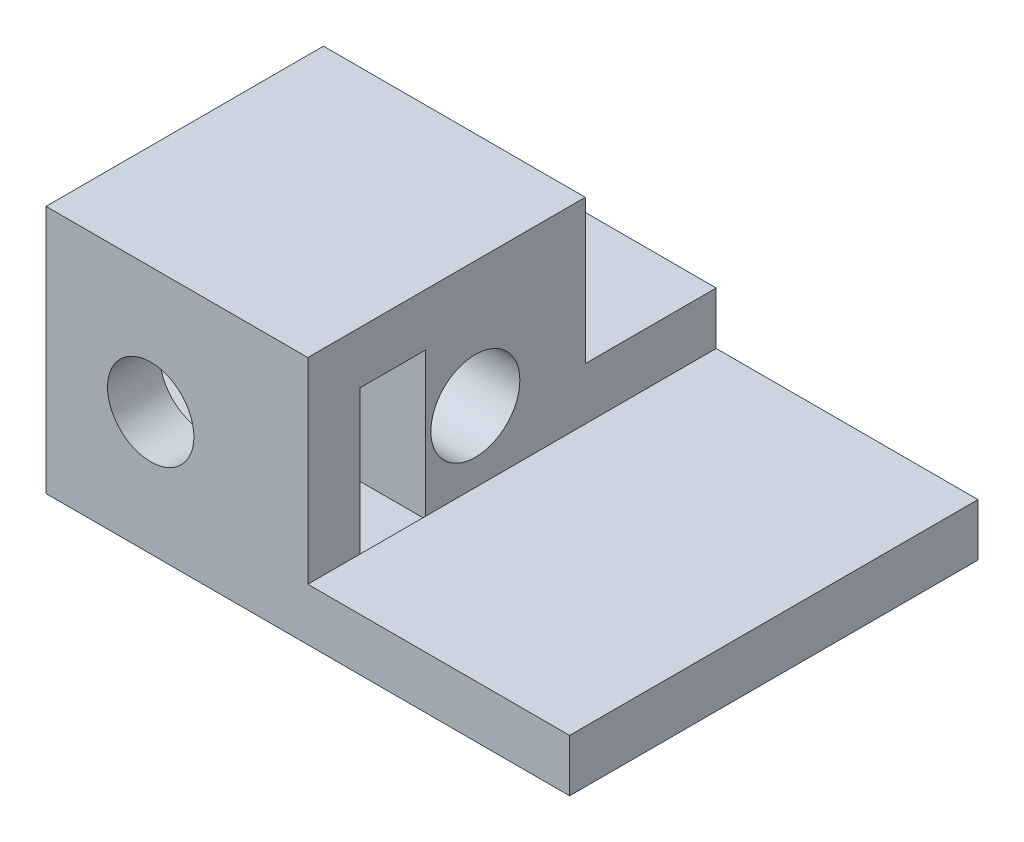
ISO-10303-21;
HEADER;
FILE_DESCRIPTION(('STEP AP214'),'2;1');
FILE_NAME('part.step','',(''),(''),'','','');
FILE_SCHEMA(('AUTOMOTIVE_DESIGN { 1 0 10303 214 1 1 1 1 }'));
ENDSEC;
DATA;
#1=APPLICATION_CONTEXT('core data for automotive mechanical design processes');
#2=APPLICATION_PROTOCOL_DEFINITION('international standard','automotive_design',2000,#1);
#3=PRODUCT_CONTEXT('',#1,'mechanical');
#4=PRODUCT('Part','Part','',(#3));
#5=PRODUCT_RELATED_PRODUCT_CATEGORY('part','',(#4));
#6=PRODUCT_DEFINITION_FORMATION('','',#4);
#7=PRODUCT_DEFINITION_CONTEXT('part definition',#1,'design');
#8=PRODUCT_DEFINITION('design','',#6,#7);
#9=PRODUCT_DEFINITION_SHAPE('','',#8);
#10=(LENGTH_UNIT() NAMED_UNIT(*) SI_UNIT(.MILLI.,.METRE.));
#11=(NAMED_UNIT(*) PLANE_ANGLE_UNIT() SI_UNIT($,.RADIAN.));
#12=(NAMED_UNIT(*) SI_UNIT($,.STERADIAN.) SOLID_ANGLE_UNIT());
#13=UNCERTAINTY_MEASURE_WITH_UNIT(LENGTH_MEASURE(1.E-05),#10,'distance_accuracy_value','');
#14=(GEOMETRIC_REPRESENTATION_CONTEXT(3) GLOBAL_UNCERTAINTY_ASSIGNED_CONTEXT((#13)) GLOBAL_UNIT_ASSIGNED_CONTEXT((#10,
#11,#12)) REPRESENTATION_CONTEXT('',''));
#15=CARTESIAN_POINT('',(0.,0.,0.));
#16=DIRECTION('',(0.,0.,1.));
#17=DIRECTION('',(1.,0.,0.));
#18=AXIS2_PLACEMENT_3D('',#15,#16,#17);
#19=CARTESIAN_POINT('',(10.,4.,52.5));
#20=DIRECTION('',(-1.,0.,0.));
#21=DIRECTION('',(0.,0.,1.));
#22=AXIS2_PLACEMENT_3D('',#19,#20,#21);
#23=PLANE('',#22);
#24=CARTESIAN_POINT('',(10.,4.7,56.7));
#25=DIRECTION('',(1.,0.,0.));
#26=DIRECTION('',(0.,0.,-1.));
#27=AXIS2_PLACEMENT_3D('',#24,#25,#26);
#28=CIRCLE('',#27,1.7);
#29=CARTESIAN_POINT('',(10.,4.7,55.));
#30=VERTEX_POINT('',#29);
#31=EDGE_CURVE('E406',#30,#30,#28,.T.);
#32=ORIENTED_EDGE('',*,*,#31,.F.);
#33=EDGE_LOOP('',(#32));
#34=FACE_BOUND('',#33,.T.);
#35=DIRECTION('',(0.,0.,-1.));
#36=VECTOR('',#35,1.);
#37=CARTESIAN_POINT('',(10.,2.,52.5));
#38=LINE('',#37,#36);
#39=CARTESIAN_POINT('',(10.,2.,58.6));
#40=VERTEX_POINT('',#39);
#41=CARTESIAN_POINT('',(10.,2.,47.5));
#42=VERTEX_POINT('',#41);
#43=EDGE_CURVE('E428',#40,#42,#38,.T.);
#44=ORIENTED_EDGE('',*,*,#43,.T.);
#45=DIRECTION('',(0.,1.,0.));
#46=VECTOR('',#45,1.);
#47=CARTESIAN_POINT('',(10.,4.,47.5));
#48=LINE('',#47,#46);
#49=CARTESIAN_POINT('',(10.,4.,47.5));
#50=VERTEX_POINT('',#49);
#51=EDGE_CURVE('E137',#42,#50,#48,.T.);
#52=ORIENTED_EDGE('',*,*,#51,.T.);
#53=DIRECTION('',(0.,0.,-1.));
#54=VECTOR('',#53,1.);
#55=CARTESIAN_POINT('',(10.,4.,52.5));
#56=LINE('',#55,#54);
#57=CARTESIAN_POINT('',(10.,4.,52.5));
#58=VERTEX_POINT('',#57);
#59=EDGE_CURVE('E426',#58,#50,#56,.T.);
#60=ORIENTED_EDGE('',*,*,#59,.F.);
#61=DIRECTION('',(0.,1.,0.));
#62=VECTOR('',#61,1.);
#63=CARTESIAN_POINT('',(10.,9.49999999999999,52.5));
#64=LINE('',#63,#62);
#65=CARTESIAN_POINT('',(10.,9.49999999999999,52.5));
#66=VERTEX_POINT('',#65);
#67=EDGE_CURVE('E392',#58,#66,#64,.T.);
#68=ORIENTED_EDGE('',*,*,#67,.T.);
#69=DIRECTION('',(0.,0.,1.));
#70=VECTOR('',#69,1.);
#71=CARTESIAN_POINT('',(10.,9.49999999999999,52.5));
#72=LINE('',#71,#70);
#73=CARTESIAN_POINT('',(10.,9.49999999999999,63.1));
#74=VERTEX_POINT('',#73);
#75=EDGE_CURVE('E400',#66,#74,#72,.T.);
#76=ORIENTED_EDGE('',*,*,#75,.T.);
#77=DIRECTION('',(0.,-1.,0.));
#78=VECTOR('',#77,1.);
#79=CARTESIAN_POINT('',(10.,9.49999999999999,63.1));
#80=LINE('',#79,#78);
#81=CARTESIAN_POINT('',(10.,2.,63.1));
#82=VERTEX_POINT('',#81);
#83=EDGE_CURVE('E403',#74,#82,#80,.T.);
#84=ORIENTED_EDGE('',*,*,#83,.T.);
#85=DIRECTION('',(0.,0.,-1.));
#86=VECTOR('',#85,1.);
#87=CARTESIAN_POINT('',(10.,2.,73.2980390271856));
#88=LINE('',#87,#86);
#89=CARTESIAN_POINT('',(10.,2.,61.1));
#90=VERTEX_POINT('',#89);
#91=EDGE_CURVE('E152',#82,#90,#88,.T.);
#92=ORIENTED_EDGE('',*,*,#91,.T.);
#93=DIRECTION('',(0.,-1.,0.));
#94=VECTOR('',#93,1.);
#95=CARTESIAN_POINT('',(10.,7.49999999999999,61.1));
#96=LINE('',#95,#94);
#97=CARTESIAN_POINT('',(10.,7.49999999999999,61.1));
#98=VERTEX_POINT('',#97);
#99=EDGE_CURVE('E460',#98,#90,#96,.T.);
#100=ORIENTED_EDGE('',*,*,#99,.F.);
#101=DIRECTION('',(0.,0.,1.));
#102=VECTOR('',#101,1.);
#103=CARTESIAN_POINT('',(10.,7.49999999999999,61.1));
#104=LINE('',#103,#102);
#105=CARTESIAN_POINT('',(10.,7.49999999999999,58.6));
#106=VERTEX_POINT('',#105);
#107=EDGE_CURVE('E462',#106,#98,#104,.T.);
#108=ORIENTED_EDGE('',*,*,#107,.F.);
#109=DIRECTION('',(0.,1.,0.));
#110=VECTOR('',#109,1.);
#111=CARTESIAN_POINT('',(10.,7.49999999999999,58.6));
#112=LINE('',#111,#110);
#113=EDGE_CURVE('E175',#40,#106,#112,.T.);
#114=ORIENTED_EDGE('',*,*,#113,.F.);
#115=EDGE_LOOP('',(#44,#52,#60,#68,#76,#84,#92,#100,#108,#114));
#116=FACE_BOUND('',#115,.T.);
#117=ADVANCED_FACE('F33',(#34,#116),#23,.F.);
#118=CARTESIAN_POINT('',(20.,0.,52.5));
#119=DIRECTION('',(0.,1.,0.));
#120=DIRECTION('',(-1.,0.,0.));
#121=AXIS2_PLACEMENT_3D('',#118,#119,#120);
#122=PLANE('',#121);
#123=DIRECTION('',(0.,0.,-1.));
#124=VECTOR('',#123,1.);
#125=CARTESIAN_POINT('',(0.,0.,52.5));
#126=LINE('',#125,#124);
#127=CARTESIAN_POINT('',(0.,0.,63.1));
#128=VERTEX_POINT('',#127);
#129=CARTESIAN_POINT('',(0.,0.,47.5));
#130=VERTEX_POINT('',#129);
#131=EDGE_CURVE('E142',#128,#130,#126,.T.);
#132=ORIENTED_EDGE('',*,*,#131,.T.);
#133=DIRECTION('',(1.,0.,0.));
#134=VECTOR('',#133,1.);
#135=CARTESIAN_POINT('',(0.,0.,47.5));
#136=LINE('',#135,#134);
#137=CARTESIAN_POINT('',(20.,0.,47.5));
#138=VERTEX_POINT('',#137);
#139=EDGE_CURVE('E131',#130,#138,#136,.T.);
#140=ORIENTED_EDGE('',*,*,#139,.T.);
#141=DIRECTION('',(0.,0.,-1.));
#142=VECTOR('',#141,1.);
#143=CARTESIAN_POINT('',(20.,0.,52.5));
#144=LINE('',#143,#142);
#145=CARTESIAN_POINT('',(20.,0.,63.1));
#146=VERTEX_POINT('',#145);
#147=EDGE_CURVE('E11',#146,#138,#144,.T.);
#148=ORIENTED_EDGE('',*,*,#147,.F.);
#149=DIRECTION('',(1.,0.,0.));
#150=VECTOR('',#149,1.);
#151=CARTESIAN_POINT('',(0.,0.,63.1));
#152=LINE('',#151,#150);
#153=EDGE_CURVE('E415',#128,#146,#152,.T.);
#154=ORIENTED_EDGE('',*,*,#153,.F.);
#155=EDGE_LOOP('',(#132,#140,#148,#154));
#156=FACE_BOUND('',#155,.T.);
#157=ADVANCED_FACE('F35',(#156),#122,.F.);
#158=CARTESIAN_POINT('',(20.,2.,52.5));
#159=DIRECTION('',(-1.,0.,0.));
#160=DIRECTION('',(0.,0.,1.));
#161=AXIS2_PLACEMENT_3D('',#158,#159,#160);
#162=PLANE('',#161);
#163=ORIENTED_EDGE('',*,*,#147,.T.);
#164=DIRECTION('',(0.,1.,0.));
#165=VECTOR('',#164,1.);
#166=CARTESIAN_POINT('',(20.,0.,47.5));
#167=LINE('',#166,#165);
#168=CARTESIAN_POINT('',(20.,2.,47.5));
#169=VERTEX_POINT('',#168);
#170=EDGE_CURVE('E128',#138,#169,#167,.T.);
#171=ORIENTED_EDGE('',*,*,#170,.T.);
#172=DIRECTION('',(0.,0.,-1.));
#173=VECTOR('',#172,1.);
#174=CARTESIAN_POINT('',(20.,2.,52.5));
#175=LINE('',#174,#173);
#176=CARTESIAN_POINT('',(20.,2.,63.1));
#177=VERTEX_POINT('',#176);
#178=EDGE_CURVE('E42',#177,#169,#175,.T.);
#179=ORIENTED_EDGE('',*,*,#178,.F.);
#180=DIRECTION('',(0.,1.,0.));
#181=VECTOR('',#180,1.);
#182=CARTESIAN_POINT('',(20.,0.,63.1));
#183=LINE('',#182,#181);
#184=EDGE_CURVE('E147',#146,#177,#183,.T.);
#185=ORIENTED_EDGE('',*,*,#184,.F.);
#186=EDGE_LOOP('',(#163,#171,#179,#185));
#187=FACE_BOUND('',#186,.T.);
#188=ADVANCED_FACE('F145',(#187),#162,.F.);
#189=CARTESIAN_POINT('',(10.,2.,52.5));
#190=DIRECTION('',(0.,-1.,0.));
#191=DIRECTION('',(0.,0.,-1.));
#192=AXIS2_PLACEMENT_3D('',#189,#190,#191);
#193=PLANE('',#192);
#194=ORIENTED_EDGE('',*,*,#178,.T.);
#195=DIRECTION('',(-1.,0.,0.));
#196=VECTOR('',#195,1.);
#197=CARTESIAN_POINT('',(10.,2.,47.5));
#198=LINE('',#197,#196);
#199=EDGE_CURVE('E134',#169,#42,#198,.T.);
#200=ORIENTED_EDGE('',*,*,#199,.T.);
#201=ORIENTED_EDGE('',*,*,#43,.F.);
#202=EDGE_CURVE('E157',#90,#40,#88,.T.);
#203=ORIENTED_EDGE('',*,*,#202,.F.);
#204=ORIENTED_EDGE('',*,*,#91,.F.);
#205=DIRECTION('',(-1.,0.,0.));
#206=VECTOR('',#205,1.);
#207=CARTESIAN_POINT('',(20.,2.,63.1));
#208=LINE('',#207,#206);
#209=EDGE_CURVE('E151',#177,#82,#208,.T.);
#210=ORIENTED_EDGE('',*,*,#209,.F.);
#211=EDGE_LOOP('',(#194,#200,#201,#203,#204,#210));
#212=FACE_BOUND('',#211,.T.);
#213=ADVANCED_FACE('F223',(#212),#193,.F.);
#214=CARTESIAN_POINT('',(5.,4.,52.5));
#215=DIRECTION('',(0.,-1.,0.));
#216=DIRECTION('',(0.,0.,-1.));
#217=AXIS2_PLACEMENT_3D('',#214,#215,#216);
#218=PLANE('',#217);
#219=ORIENTED_EDGE('',*,*,#59,.T.);
#220=DIRECTION('',(-1.,0.,0.));
#221=VECTOR('',#220,1.);
#222=CARTESIAN_POINT('',(0.,4.,47.5));
#223=LINE('',#222,#221);
#224=CARTESIAN_POINT('',(0.,4.,47.5));
#225=VERTEX_POINT('',#224);
#226=EDGE_CURVE('E58',#50,#225,#223,.T.);
#227=ORIENTED_EDGE('',*,*,#226,.T.);
#228=DIRECTION('',(0.,0.,1.));
#229=VECTOR('',#228,1.);
#230=CARTESIAN_POINT('',(0.,4.,47.5));
#231=LINE('',#230,#229);
#232=CARTESIAN_POINT('',(0.,4.,52.5));
#233=VERTEX_POINT('',#232);
#234=EDGE_CURVE('E422',#225,#233,#231,.T.);
#235=ORIENTED_EDGE('',*,*,#234,.T.);
#236=DIRECTION('',(-1.,0.,0.));
#237=VECTOR('',#236,1.);
#238=CARTESIAN_POINT('',(5.,4.,52.5));
#239=LINE('',#238,#237);
#240=EDGE_CURVE('E393',#58,#233,#239,.T.);
#241=ORIENTED_EDGE('',*,*,#240,.F.);
#242=EDGE_LOOP('',(#219,#227,#235,#241));
#243=FACE_BOUND('',#242,.T.);
#244=ADVANCED_FACE('F221',(#243),#218,.F.);
#245=CARTESIAN_POINT('',(0.,0.,52.5));
#246=DIRECTION('',(1.,0.,0.));
#247=DIRECTION('',(0.,0.,-1.));
#248=AXIS2_PLACEMENT_3D('',#245,#246,#247);
#249=PLANE('',#248);
#250=DIRECTION('',(0.,-1.,0.));
#251=VECTOR('',#250,1.);
#252=CARTESIAN_POINT('',(0.,0.,47.5));
#253=LINE('',#252,#251);
#254=EDGE_CURVE('E49',#225,#130,#253,.T.);
#255=ORIENTED_EDGE('',*,*,#254,.T.);
#256=ORIENTED_EDGE('',*,*,#131,.F.);
#257=DIRECTION('',(0.,-1.,0.));
#258=VECTOR('',#257,1.);
#259=CARTESIAN_POINT('',(0.,9.49999999999999,63.1));
#260=LINE('',#259,#258);
#261=CARTESIAN_POINT('',(0.,9.49999999999999,63.1));
#262=VERTEX_POINT('',#261);
#263=EDGE_CURVE('E409',#262,#128,#260,.T.);
#264=ORIENTED_EDGE('',*,*,#263,.F.);
#265=DIRECTION('',(0.,0.,1.));
#266=VECTOR('',#265,1.);
#267=CARTESIAN_POINT('',(0.,9.49999999999999,52.5));
#268=LINE('',#267,#266);
#269=CARTESIAN_POINT('',(0.,9.49999999999999,52.5));
#270=VERTEX_POINT('',#269);
#271=EDGE_CURVE('E437',#270,#262,#268,.T.);
#272=ORIENTED_EDGE('',*,*,#271,.F.);
#273=DIRECTION('',(0.,1.,0.));
#274=VECTOR('',#273,1.);
#275=CARTESIAN_POINT('',(0.,3.74294307873424,52.5));
#276=LINE('',#275,#274);
#277=EDGE_CURVE('E414',#233,#270,#276,.T.);
#278=ORIENTED_EDGE('',*,*,#277,.F.);
#279=ORIENTED_EDGE('',*,*,#234,.F.);
#280=EDGE_LOOP('',(#255,#256,#264,#272,#278,#279));
#281=FACE_BOUND('',#280,.T.);
#282=DIRECTION('',(0.,0.,-1.));
#283=VECTOR('',#282,1.);
#284=CARTESIAN_POINT('',(0.,1.89999999999999,61.1));
#285=LINE('',#284,#283);
#286=CARTESIAN_POINT('',(0.,1.89999999999999,61.1));
#287=VERTEX_POINT('',#286);
#288=CARTESIAN_POINT('',(0.,1.89999999999999,58.6));
#289=VERTEX_POINT('',#288);
#290=EDGE_CURVE('E450',#287,#289,#285,.T.);
#291=ORIENTED_EDGE('',*,*,#290,.T.);
#292=DIRECTION('',(0.,1.,0.));
#293=VECTOR('',#292,1.);
#294=CARTESIAN_POINT('',(0.,7.49999999999999,58.6));
#295=LINE('',#294,#293);
#296=CARTESIAN_POINT('',(0.,7.49999999999999,58.6));
#297=VERTEX_POINT('',#296);
#298=EDGE_CURVE('E176',#289,#297,#295,.T.);
#299=ORIENTED_EDGE('',*,*,#298,.T.);
#300=DIRECTION('',(0.,0.,1.));
#301=VECTOR('',#300,1.);
#302=CARTESIAN_POINT('',(0.,7.49999999999999,61.1));
#303=LINE('',#302,#301);
#304=CARTESIAN_POINT('',(0.,7.49999999999999,61.1));
#305=VERTEX_POINT('',#304);
#306=EDGE_CURVE('E472',#297,#305,#303,.T.);
#307=ORIENTED_EDGE('',*,*,#306,.T.);
#308=DIRECTION('',(0.,-1.,0.));
#309=VECTOR('',#308,1.);
#310=CARTESIAN_POINT('',(0.,7.49999999999999,61.1));
#311=LINE('',#310,#309);
#312=EDGE_CURVE('E470',#305,#287,#311,.T.);
#313=ORIENTED_EDGE('',*,*,#312,.T.);
#314=EDGE_LOOP('',(#291,#299,#307,#313));
#315=FACE_BOUND('',#314,.T.);
#316=CARTESIAN_POINT('',(0.,4.7,56.7));
#317=DIRECTION('',(1.,0.,0.));
#318=DIRECTION('',(0.,0.,-1.));
#319=AXIS2_PLACEMENT_3D('',#316,#317,#318);
#320=CIRCLE('',#319,1.7);
#321=CARTESIAN_POINT('',(0.,4.7,55.));
#322=VERTEX_POINT('',#321);
#323=EDGE_CURVE('E401',#322,#322,#320,.T.);
#324=ORIENTED_EDGE('',*,*,#323,.T.);
#325=EDGE_LOOP('',(#324));
#326=FACE_BOUND('',#325,.T.);
#327=ADVANCED_FACE('F241',(#281,#315,#326),#249,.F.);
#328=CARTESIAN_POINT('',(0.,0.,47.5));
#329=DIRECTION('',(0.,0.,-1.));
#330=DIRECTION('',(-1.,0.,0.));
#331=AXIS2_PLACEMENT_3D('',#328,#329,#330);
#332=PLANE('',#331);
#333=ORIENTED_EDGE('',*,*,#226,.F.);
#334=ORIENTED_EDGE('',*,*,#51,.F.);
#335=ORIENTED_EDGE('',*,*,#199,.F.);
#336=ORIENTED_EDGE('',*,*,#170,.F.);
#337=ORIENTED_EDGE('',*,*,#139,.F.);
#338=ORIENTED_EDGE('',*,*,#254,.F.);
#339=EDGE_LOOP('',(#333,#334,#335,#336,#337,#338));
#340=FACE_BOUND('',#339,.T.);
#341=ADVANCED_FACE('F130',(#340),#332,.T.);
#342=CARTESIAN_POINT('',(0.,9.49999999999999,63.1));
#343=DIRECTION('',(0.,0.,1.));
#344=DIRECTION('',(1.,0.,0.));
#345=AXIS2_PLACEMENT_3D('',#342,#343,#344);
#346=PLANE('',#345);
#347=CARTESIAN_POINT('',(4.,4.69999999999999,63.1));
#348=DIRECTION('',(0.,0.,1.));
#349=DIRECTION('',(1.,0.,0.));
#350=AXIS2_PLACEMENT_3D('',#347,#348,#349);
#351=CIRCLE('',#350,1.65);
#352=CARTESIAN_POINT('',(5.65,4.69999999999999,63.1));
#353=VERTEX_POINT('',#352);
#354=EDGE_CURVE('E162',#353,#353,#351,.T.);
#355=ORIENTED_EDGE('',*,*,#354,.F.);
#356=EDGE_LOOP('',(#355));
#357=FACE_BOUND('',#356,.T.);
#358=ORIENTED_EDGE('',*,*,#83,.F.);
#359=DIRECTION('',(1.,0.,0.));
#360=VECTOR('',#359,1.);
#361=CARTESIAN_POINT('',(0.,9.49999999999999,63.1));
#362=LINE('',#361,#360);
#363=EDGE_CURVE('E417',#262,#74,#362,.T.);
#364=ORIENTED_EDGE('',*,*,#363,.F.);
#365=ORIENTED_EDGE('',*,*,#263,.T.);
#366=ORIENTED_EDGE('',*,*,#153,.T.);
#367=ORIENTED_EDGE('',*,*,#184,.T.);
#368=ORIENTED_EDGE('',*,*,#209,.T.);
#369=EDGE_LOOP('',(#358,#364,#365,#366,#367,#368));
#370=FACE_BOUND('',#369,.T.);
#371=ADVANCED_FACE('F253',(#357,#370),#346,.T.);
#372=CARTESIAN_POINT('',(0.,9.49999999999999,52.5));
#373=DIRECTION('',(0.,1.,0.));
#374=DIRECTION('',(0.,0.,1.));
#375=AXIS2_PLACEMENT_3D('',#372,#373,#374);
#376=PLANE('',#375);
#377=ORIENTED_EDGE('',*,*,#75,.F.);
#378=DIRECTION('',(1.,0.,0.));
#379=VECTOR('',#378,1.);
#380=CARTESIAN_POINT('',(0.,9.49999999999999,52.5));
#381=LINE('',#380,#379);
#382=EDGE_CURVE('E396',#270,#66,#381,.T.);
#383=ORIENTED_EDGE('',*,*,#382,.F.);
#384=ORIENTED_EDGE('',*,*,#271,.T.);
#385=ORIENTED_EDGE('',*,*,#363,.T.);
#386=EDGE_LOOP('',(#377,#383,#384,#385));
#387=FACE_BOUND('',#386,.T.);
#388=ADVANCED_FACE('F298',(#387),#376,.T.);
#389=CARTESIAN_POINT('',(0.,9.49999999999999,52.5));
#390=DIRECTION('',(0.,0.,-1.));
#391=DIRECTION('',(-1.,0.,0.));
#392=AXIS2_PLACEMENT_3D('',#389,#390,#391);
#393=PLANE('',#392);
#394=ORIENTED_EDGE('',*,*,#67,.F.);
#395=ORIENTED_EDGE('',*,*,#240,.T.);
#396=ORIENTED_EDGE('',*,*,#277,.T.);
#397=ORIENTED_EDGE('',*,*,#382,.T.);
#398=EDGE_LOOP('',(#394,#395,#396,#397));
#399=FACE_BOUND('',#398,.T.);
#400=ADVANCED_FACE('F207',(#399),#393,.T.);
#401=CARTESIAN_POINT('',(0.,4.7,56.7));
#402=DIRECTION('',(1.,0.,0.));
#403=DIRECTION('',(0.,0.,-1.));
#404=AXIS2_PLACEMENT_3D('',#401,#402,#403);
#405=CYLINDRICAL_SURFACE('',#404,1.7);
#406=CARTESIAN_POINT('',(5.65,4.69999999999999,58.4));
#407=CARTESIAN_POINT('',(5.6499951191206,4.77431664748442,58.3999951381305));
#408=CARTESIAN_POINT('',(5.64492930071051,4.84876938643304,58.3950771032798));
#409=CARTESIAN_POINT('',(5.6250684668931,4.99520668784693,58.3758108215982));
#410=CARTESIAN_POINT('',(5.61024652517089,5.06718383764897,58.3614364759775));
#411=CARTESIAN_POINT('',(5.57213129066758,5.20601241203361,58.3245228301415));
#412=CARTESIAN_POINT('',(5.548899867164,5.27289706099651,58.3020431660849));
#413=CARTESIAN_POINT('',(5.4953587084577,5.40087282502318,58.2503385173098));
#414=CARTESIAN_POINT('',(5.46504979885824,5.46196461466801,58.2211143193597));
#415=CARTESIAN_POINT('',(5.38508986533381,5.60160105528948,58.14423242797));
#416=CARTESIAN_POINT('',(5.3325994053781,5.67705618097948,58.0939254772918));
#417=CARTESIAN_POINT('',(5.21916245162072,5.81543315344476,57.9859044682358));
#418=CARTESIAN_POINT('',(5.15819166380151,5.8783176801536,57.9281691664389));
#419=CARTESIAN_POINT('',(5.05058377464767,5.97363518192006,57.8273847775553));
#420=CARTESIAN_POINT('',(5.00563390161898,6.00936107894185,57.7855757966639));
#421=CARTESIAN_POINT('',(4.91316109090793,6.07545284053501,57.7005148575029));
#422=CARTESIAN_POINT('',(4.86563658579798,6.10581539089416,57.6572620265133));
#423=CARTESIAN_POINT('',(4.76826918907857,6.16130021949777,57.5702083782996));
#424=CARTESIAN_POINT('',(4.71842989042659,6.18643030750845,57.5264084827006));
#425=CARTESIAN_POINT('',(4.61620489518508,6.23164026404103,57.4392383644));
#426=CARTESIAN_POINT('',(4.56382142438058,6.25172445530441,57.3958678047059));
#427=CARTESIAN_POINT('',(4.47402523735884,6.28088693112952,57.3258670409783));
#428=CARTESIAN_POINT('',(4.43759204293031,6.2913836814702,57.2985674333069));
#429=CARTESIAN_POINT('',(4.36258977808618,6.31013299861363,57.2461119750531));
#430=CARTESIAN_POINT('',(4.32402079807609,6.31838566031896,57.2209560338459));
#431=CARTESIAN_POINT('',(4.25614459599467,6.33023980883169,57.1822808160497));
#432=CARTESIAN_POINT('',(4.22764833090389,6.33449083392074,57.1675651116565));
#433=CARTESIAN_POINT('',(4.16882435274054,6.34160584386233,57.1419350584685));
#434=CARTESIAN_POINT('',(4.13850266761676,6.34447413956376,57.1310089254443));
#435=CARTESIAN_POINT('',(4.08446100321664,6.3479957059507,57.1173103624399));
#436=CARTESIAN_POINT('',(4.06113561450244,6.34903559890722,57.1131408641676));
#437=CARTESIAN_POINT('',(4.01411261522201,6.35010636727617,57.1088459256469));
#438=CARTESIAN_POINT('',(3.99041581069267,6.35013918787983,57.1087126892409));
#439=CARTESIAN_POINT('',(3.9434444964609,6.34919794784926,57.1124903747548));
#440=CARTESIAN_POINT('',(3.92016912925235,6.34822624019747,57.1163918458821));
#441=CARTESIAN_POINT('',(3.87446115781321,6.34537714909113,57.1275137882329));
#442=CARTESIAN_POINT('',(3.852030907177,6.34349741271196,57.1347428798304));
#443=CARTESIAN_POINT('',(3.77604529828152,6.33563931500054,57.1638094187145));
#444=CARTESIAN_POINT('',(3.72505019617808,6.32769154578367,57.1915293962054));
#445=CARTESIAN_POINT('',(3.62707837123593,6.30808699156098,57.2523757111051));
#446=CARTESIAN_POINT('',(3.58013924377193,6.29639943367386,57.2855457518586));
#447=CARTESIAN_POINT('',(3.48489721607571,6.26838465143437,57.3570933919134));
#448=CARTESIAN_POINT('',(3.43683637170529,6.25174018110689,57.3956725169022));
#449=CARTESIAN_POINT('',(3.34296902530662,6.21438524524159,57.4736385079659));
#450=CARTESIAN_POINT('',(3.29716461531949,6.19367109206932,57.5130260773868));
#451=CARTESIAN_POINT('',(3.20765040061997,6.14816879149687,57.5915495632997));
#452=CARTESIAN_POINT('',(3.16393497932761,6.12339246668793,57.6306858773541));
#453=CARTESIAN_POINT('',(3.07848464350091,6.06961867202806,57.7081510881335));
#454=CARTESIAN_POINT('',(3.03674882856918,6.04062314611599,57.7464803474383));
#455=CARTESIAN_POINT('',(2.92650473382593,5.95610453546225,57.8485620253281));
#456=CARTESIAN_POINT('',(2.85999756889061,5.89635025801581,57.911069403455));
#457=CARTESIAN_POINT('',(2.73500283256367,5.76329063847794,58.0294075289678));
#458=CARTESIAN_POINT('',(2.67650651184415,5.6900002891954,58.0852455518645));
#459=CARTESIAN_POINT('',(2.58353670515514,5.54934573962177,58.1743608129445));
#460=CARTESIAN_POINT('',(2.54669071764703,5.48494080131927,58.209811851842));
#461=CARTESIAN_POINT('',(2.48100469606942,5.34872774403982,58.2731403943408));
#462=CARTESIAN_POINT('',(2.45215418264639,5.27692948620786,58.3010278102518));
#463=CARTESIAN_POINT('',(2.40789122780361,5.13836448330115,58.3438626228807));
#464=CARTESIAN_POINT('',(2.3911171307268,5.0724416749008,58.3601188517723));
#465=CARTESIAN_POINT('',(2.36575889989505,4.93759679087981,58.3847059689213));
#466=CARTESIAN_POINT('',(2.35717028167828,4.86867637918044,58.3930411967377));
#467=CARTESIAN_POINT('',(2.34879222170757,4.72960876107609,58.4011719711327));
#468=CARTESIAN_POINT('',(2.34902579415877,4.65945882322501,58.4009451822154));
#469=CARTESIAN_POINT('',(2.35833110360212,4.52031083736976,58.3919147616639));
#470=CARTESIAN_POINT('',(2.36740442137269,4.45131299763567,58.3831095959909));
#471=CARTESIAN_POINT('',(2.39323089015601,4.31898660130429,58.3580703706136));
#472=CARTESIAN_POINT('',(2.40968361145004,4.25554249403087,58.3421269638031));
#473=CARTESIAN_POINT('',(2.44920725563624,4.13280864420312,58.3038808280654));
#474=CARTESIAN_POINT('',(2.47228009769563,4.07352011255717,58.2815762550528));
#475=CARTESIAN_POINT('',(2.53448171483141,3.936817881807,58.2215618340179));
#476=CARTESIAN_POINT('',(2.57633009752721,3.86177144788428,58.1812698632994));
#477=CARTESIAN_POINT('',(2.66843037858381,3.72200848188587,58.092985667479));
#478=CARTESIAN_POINT('',(2.71870489320831,3.65732069209685,58.0449727332745));
#479=CARTESIAN_POINT('',(2.84537634591466,3.5162068489431,57.9247834550311));
#480=CARTESIAN_POINT('',(2.92455856657558,3.44428502112513,57.850236986777));
#481=CARTESIAN_POINT('',(3.04960519636637,3.35019796316759,57.7346525443981));
#482=CARTESIAN_POINT('',(3.09231891631523,3.32114167940197,57.6955095029556));
#483=CARTESIAN_POINT('',(3.17976053484293,3.26740129968965,57.6164814563199));
#484=CARTESIAN_POINT('',(3.22448758068934,3.24271537415571,57.5765967693701));
#485=CARTESIAN_POINT('',(3.3127689819342,3.19917814771136,57.4995942438009));
#486=CARTESIAN_POINT('',(3.35618515605978,3.18003886882327,57.4624787742881));
#487=CARTESIAN_POINT('',(3.44527605308351,3.14530590107838,57.3888982236239));
#488=CARTESIAN_POINT('',(3.49095837545035,3.12972528378952,57.3524359796931));
#489=CARTESIAN_POINT('',(3.5856670001053,3.10209226346595,57.281508938417));
#490=CARTESIAN_POINT('',(3.63472477925376,3.0900809220195,57.2470707898261));
#491=CARTESIAN_POINT('',(3.73752776601328,3.07017628788367,57.1844656145668));
#492=CARTESIAN_POINT('',(3.79123110521247,3.0622499400123,57.1562493423308));
#493=CARTESIAN_POINT('',(3.87408171091572,3.05461142344483,57.1275457319283));
#494=CARTESIAN_POINT('',(3.90054092830808,3.052778441047,57.1203380291202));
#495=CARTESIAN_POINT('',(3.95430999594916,3.0504152560474,57.1109670867461));
#496=CARTESIAN_POINT('',(3.98161431230738,3.04987788186746,57.1087760816735));
#497=CARTESIAN_POINT('',(4.03615841076965,3.05016997610175,57.1099521134643));
#498=CARTESIAN_POINT('',(4.06339782575893,3.05100309884909,57.1133340101177));
#499=CARTESIAN_POINT('',(4.11688054899291,3.05392485840269,57.1248188542482));
#500=CARTESIAN_POINT('',(4.14311712286117,3.05602078771142,57.1329492149106));
#501=CARTESIAN_POINT('',(4.22221384883654,3.06413985257876,57.1630140154993));
#502=CARTESIAN_POINT('',(4.27273358204429,3.07194945447585,57.1903108777091));
#503=CARTESIAN_POINT('',(4.36974331149571,3.09119659353304,57.2502548178951));
#504=CARTESIAN_POINT('',(4.41620297654061,3.10265888153936,57.2829376397738));
#505=CARTESIAN_POINT('',(4.51054340342409,3.13014098227627,57.3535306077778));
#506=CARTESIAN_POINT('',(4.55817999729433,3.14647658751454,57.3916468735035));
#507=CARTESIAN_POINT('',(4.65122589577985,3.18312647001671,57.4687169964646));
#508=CARTESIAN_POINT('',(4.69663317721863,3.20344428075054,57.507671570015));
#509=CARTESIAN_POINT('',(4.78540797194255,3.24807237020936,57.5853865951835));
#510=CARTESIAN_POINT('',(4.82878015388732,3.27237287189491,57.6241472884379));
#511=CARTESIAN_POINT('',(4.91358919113673,3.32510164763037,57.7009113940666));
#512=CARTESIAN_POINT('',(4.9550268923744,3.35352809466212,57.7389151332023));
#513=CARTESIAN_POINT('',(5.06575047511444,3.437282155099,57.8413153655833));
#514=CARTESIAN_POINT('',(5.13298847741862,3.49696649808093,57.9044635276466));
#515=CARTESIAN_POINT('',(5.25940457141108,3.63004965679593,58.0240823924103));
#516=CARTESIAN_POINT('',(5.31859259215261,3.70343130780774,58.08056130958));
#517=CARTESIAN_POINT('',(5.41256141435749,3.8441717416305,58.1706115680236));
#518=CARTESIAN_POINT('',(5.4497526183157,3.90849695316757,58.2063879498376));
#519=CARTESIAN_POINT('',(5.51615911387545,4.04465556654682,58.2704013514937));
#520=CARTESIAN_POINT('',(5.5453812205227,4.11648247988238,58.2986448129127));
#521=CARTESIAN_POINT('',(5.59025974024369,4.25497680204412,58.3420716609219));
#522=CARTESIAN_POINT('',(5.60730078538737,4.32077678384846,58.3585855341237));
#523=CARTESIAN_POINT('',(5.63319037437532,4.45535048912151,58.3836865910043));
#524=CARTESIAN_POINT('',(5.64206084893617,4.5241157304353,58.3922949936548));
#525=CARTESIAN_POINT('',(5.64769812213891,4.61106359457005,58.3977659160098));
#526=CARTESIAN_POINT('',(5.64856016038503,4.62882660813309,58.3986025367794));
#527=CARTESIAN_POINT('',(5.64971172172548,4.66439047306594,58.3997201977945));
#528=CARTESIAN_POINT('',(5.65000116961647,4.68219132909863,58.4000011650611));
#529=CARTESIAN_POINT('',(5.65,4.69999999999999,58.4));
#530=B_SPLINE_CURVE_WITH_KNOTS('',3,(#406,#407,#408,#409,#410,#411,#412,#413,#414,#415,#416,
#417,#418,#419,#420,#421,#422,#423,#424,#425,#426,#427,#428,#429,#430,#431,#432,#433,#434,#435,
#436,#437,#438,#439,#440,#441,#442,#443,#444,#445,#446,#447,#448,#449,#450,#451,#452,#453,#454,
#455,#456,#457,#458,#459,#460,#461,#462,#463,#464,#465,#466,#467,#468,#469,#470,#471,#472,#473,
#474,#475,#476,#477,#478,#479,#480,#481,#482,#483,#484,#485,#486,#487,#488,#489,#490,#491,#492,
#493,#494,#495,#496,#497,#498,#499,#500,#501,#502,#503,#504,#505,#506,#507,#508,#509,#510,#511,
#512,#513,#514,#515,#516,#517,#518,#519,#520,#521,#522,#523,#524,#525,#526,#527,#528,#529),
.UNSPECIFIED.,.T.,.F.,(4,2,2,2,2,2,2,2,2,2,2,2,2,2,2,2,2,2,2,2,2,2,2,2,2,2,2,2,2,2,2,2,2,2,2,2,
2,2,2,2,2,2,2,2,2,2,2,2,2,2,2,2,2,2,2,2,2,2,2,2,2,4),(0.,0.222867280298378,0.446352254655575,
0.668225379189323,0.890072634686505,1.2027116703107,1.51626552835676,1.72909469686683,
1.94205492387117,2.15469497956694,2.36715224385187,2.50722974269469,2.64730131673396,
2.74418479033629,2.84076423101711,2.91160089843029,2.98230073401035,3.05283533844003,
3.12355370377806,3.2979116123416,3.47374280565069,3.66501067115119,3.85645265496402,
4.04734704464354,4.23815375921841,4.56426004348135,4.89000726917351,5.13581711122665,
5.38130323968813,5.59021735169148,5.79901694298791,6.00836126153795,6.217743023218,
6.41928106814492,6.62087759790902,6.90400702528389,7.18790893044793,7.57678870271484,
7.77110960978223,7.96534897385307,8.14594940817759,8.3272029162029,8.51046734264325,
8.69222456849431,8.77428645059848,8.85589304214427,8.93771758480499,9.02001924155402,
9.19253435339212,9.36624422593923,9.55548102754437,9.74488650821523,9.93383379996755,
10.1226976774125,10.4511188707294,10.7791312343744,11.0256457565038,11.2719487974718,
11.4809294719474,11.6893475705192,11.7427467617775,11.7961529659573),.UNSPECIFIED.);
#531=CARTESIAN_POINT('',(5.65,4.69999999999999,58.4));
#532=VERTEX_POINT('',#531);
#533=EDGE_CURVE('E168',#532,#532,#530,.T.);
#534=ORIENTED_EDGE('',*,*,#533,.T.);
#535=EDGE_LOOP('',(#534));
#536=FACE_BOUND('',#535,.T.);
#537=ORIENTED_EDGE('',*,*,#323,.F.);
#538=EDGE_LOOP('',(#537));
#539=FACE_BOUND('',#538,.T.);
#540=ORIENTED_EDGE('',*,*,#31,.T.);
#541=EDGE_LOOP('',(#540));
#542=FACE_BOUND('',#541,.T.);
#543=ADVANCED_FACE('F178',(#536,#539,#542),#405,.F.);
#544=CARTESIAN_POINT('',(0.,7.49999999999999,58.6));
#545=DIRECTION('',(0.,0.,-1.));
#546=DIRECTION('',(-1.,0.,0.));
#547=AXIS2_PLACEMENT_3D('',#544,#545,#546);
#548=PLANE('',#547);
#549=CARTESIAN_POINT('',(4.,4.69999999999999,58.6));
#550=DIRECTION('',(0.,0.,-1.));
#551=DIRECTION('',(-1.,0.,0.));
#552=AXIS2_PLACEMENT_3D('',#549,#550,#551);
#553=CIRCLE('',#552,1.65);
#554=CARTESIAN_POINT('',(2.35,4.69999999999999,58.6));
#555=VERTEX_POINT('',#554);
#556=EDGE_CURVE('E165',#555,#555,#553,.T.);
#557=ORIENTED_EDGE('',*,*,#556,.T.);
#558=EDGE_LOOP('',(#557));
#559=FACE_BOUND('',#558,.T.);
#560=CARTESIAN_POINT('',(10.,1.89999999999999,58.6));
#561=VERTEX_POINT('',#560);
#562=EDGE_CURVE('E465',#561,#40,#112,.T.);
#563=ORIENTED_EDGE('',*,*,#562,.T.);
#564=ORIENTED_EDGE('',*,*,#113,.T.);
#565=DIRECTION('',(1.,0.,0.));
#566=VECTOR('',#565,1.);
#567=CARTESIAN_POINT('',(0.,7.49999999999999,58.6));
#568=LINE('',#567,#566);
#569=EDGE_CURVE('E446',#297,#106,#568,.T.);
#570=ORIENTED_EDGE('',*,*,#569,.F.);
#571=ORIENTED_EDGE('',*,*,#298,.F.);
#572=DIRECTION('',(1.,0.,0.));
#573=VECTOR('',#572,1.);
#574=CARTESIAN_POINT('',(0.,1.89999999999999,58.6));
#575=LINE('',#574,#573);
#576=EDGE_CURVE('E444',#289,#561,#575,.T.);
#577=ORIENTED_EDGE('',*,*,#576,.T.);
#578=EDGE_LOOP('',(#563,#564,#570,#571,#577));
#579=FACE_BOUND('',#578,.T.);
#580=ADVANCED_FACE('F194',(#559,#579),#548,.F.);
#581=CARTESIAN_POINT('',(0.,1.89999999999999,61.1));
#582=DIRECTION('',(0.,-1.,0.));
#583=DIRECTION('',(0.,0.,-1.));
#584=AXIS2_PLACEMENT_3D('',#581,#582,#583);
#585=PLANE('',#584);
#586=DIRECTION('',(0.,0.,-1.));
#587=VECTOR('',#586,1.);
#588=CARTESIAN_POINT('',(10.,1.89999999999999,61.1));
#589=LINE('',#588,#587);
#590=CARTESIAN_POINT('',(10.,1.89999999999999,61.1));
#591=VERTEX_POINT('',#590);
#592=EDGE_CURVE('E457',#591,#561,#589,.T.);
#593=ORIENTED_EDGE('',*,*,#592,.T.);
#594=ORIENTED_EDGE('',*,*,#576,.F.);
#595=ORIENTED_EDGE('',*,*,#290,.F.);
#596=DIRECTION('',(1.,0.,0.));
#597=VECTOR('',#596,1.);
#598=CARTESIAN_POINT('',(0.,1.89999999999999,61.1));
#599=LINE('',#598,#597);
#600=EDGE_CURVE('E452',#287,#591,#599,.T.);
#601=ORIENTED_EDGE('',*,*,#600,.T.);
#602=EDGE_LOOP('',(#593,#594,#595,#601));
#603=FACE_BOUND('',#602,.T.);
#604=ADVANCED_FACE('F190',(#603),#585,.F.);
#605=CARTESIAN_POINT('',(0.,7.49999999999999,61.1));
#606=DIRECTION('',(0.,0.,1.));
#607=DIRECTION('',(1.,0.,0.));
#608=AXIS2_PLACEMENT_3D('',#605,#606,#607);
#609=PLANE('',#608);
#610=CARTESIAN_POINT('',(4.,4.69999999999999,61.1));
#611=DIRECTION('',(0.,0.,1.));
#612=DIRECTION('',(1.,0.,0.));
#613=AXIS2_PLACEMENT_3D('',#610,#611,#612);
#614=CIRCLE('',#613,1.65);
#615=CARTESIAN_POINT('',(5.65,4.69999999999999,61.1));
#616=VERTEX_POINT('',#615);
#617=EDGE_CURVE('E37',#616,#616,#614,.T.);
#618=ORIENTED_EDGE('',*,*,#617,.T.);
#619=EDGE_LOOP('',(#618));
#620=FACE_BOUND('',#619,.T.);
#621=ORIENTED_EDGE('',*,*,#99,.T.);
#622=DIRECTION('',(0.,1.,0.));
#623=VECTOR('',#622,1.);
#624=CARTESIAN_POINT('',(10.,7.49999999999999,61.1));
#625=LINE('',#624,#623);
#626=EDGE_CURVE('E154',#591,#90,#625,.T.);
#627=ORIENTED_EDGE('',*,*,#626,.F.);
#628=ORIENTED_EDGE('',*,*,#600,.F.);
#629=ORIENTED_EDGE('',*,*,#312,.F.);
#630=DIRECTION('',(1.,0.,0.));
#631=VECTOR('',#630,1.);
#632=CARTESIAN_POINT('',(0.,7.49999999999999,61.1));
#633=LINE('',#632,#631);
#634=EDGE_CURVE('E449',#305,#98,#633,.T.);
#635=ORIENTED_EDGE('',*,*,#634,.T.);
#636=EDGE_LOOP('',(#621,#627,#628,#629,#635));
#637=FACE_BOUND('',#636,.T.);
#638=ADVANCED_FACE('F193',(#620,#637),#609,.F.);
#639=CARTESIAN_POINT('',(0.,7.49999999999999,61.1));
#640=DIRECTION('',(0.,1.,0.));
#641=DIRECTION('',(0.,0.,1.));
#642=AXIS2_PLACEMENT_3D('',#639,#640,#641);
#643=PLANE('',#642);
#644=ORIENTED_EDGE('',*,*,#107,.T.);
#645=ORIENTED_EDGE('',*,*,#634,.F.);
#646=ORIENTED_EDGE('',*,*,#306,.F.);
#647=ORIENTED_EDGE('',*,*,#569,.T.);
#648=EDGE_LOOP('',(#644,#645,#646,#647));
#649=FACE_BOUND('',#648,.T.);
#650=ADVANCED_FACE('F198',(#649),#643,.F.);
#651=CARTESIAN_POINT('',(4.,4.69999999999999,57.1));
#652=DIRECTION('',(0.,0.,1.));
#653=DIRECTION('',(1.,0.,0.));
#654=AXIS2_PLACEMENT_3D('',#651,#652,#653);
#655=CYLINDRICAL_SURFACE('',#654,1.65);
#656=ORIENTED_EDGE('',*,*,#354,.T.);
#657=EDGE_LOOP('',(#656));
#658=FACE_BOUND('',#657,.T.);
#659=ORIENTED_EDGE('',*,*,#617,.F.);
#660=EDGE_LOOP('',(#659));
#661=FACE_BOUND('',#660,.T.);
#662=ADVANCED_FACE('F188',(#658,#661),#655,.F.);
#663=ORIENTED_EDGE('',*,*,#556,.F.);
#664=EDGE_LOOP('',(#663));
#665=FACE_BOUND('',#664,.T.);
#666=ORIENTED_EDGE('',*,*,#533,.F.);
#667=EDGE_LOOP('',(#666));
#668=FACE_BOUND('',#667,.T.);
#669=ADVANCED_FACE('F182',(#665,#668),#655,.F.);
#670=CARTESIAN_POINT('',(10.,2.,73.2980390271856));
#671=DIRECTION('',(1.,0.,0.));
#672=DIRECTION('',(0.,0.,-1.));
#673=AXIS2_PLACEMENT_3D('',#670,#671,#672);
#674=PLANE('',#673);
#675=ORIENTED_EDGE('',*,*,#202,.T.);
#676=ORIENTED_EDGE('',*,*,#562,.F.);
#677=ORIENTED_EDGE('',*,*,#592,.F.);
#678=ORIENTED_EDGE('',*,*,#626,.T.);
#679=EDGE_LOOP('',(#675,#676,#677,#678));
#680=FACE_BOUND('',#679,.T.);
#681=ADVANCED_FACE('F187',(#680),#674,.F.);
#682=CLOSED_SHELL('',(#117,#157,#188,#213,#244,#327,#341,#371,#388,#400,#543,#580,#604,#638,
#650,#662,#669,#681));
#683=MANIFOLD_SOLID_BREP('B2',#682);
#684=ADVANCED_BREP_SHAPE_REPRESENTATION('',(#18,#683),#14);
#685=SHAPE_DEFINITION_REPRESENTATION(#9,#684);
ENDSEC;
END-ISO-10303-21;
